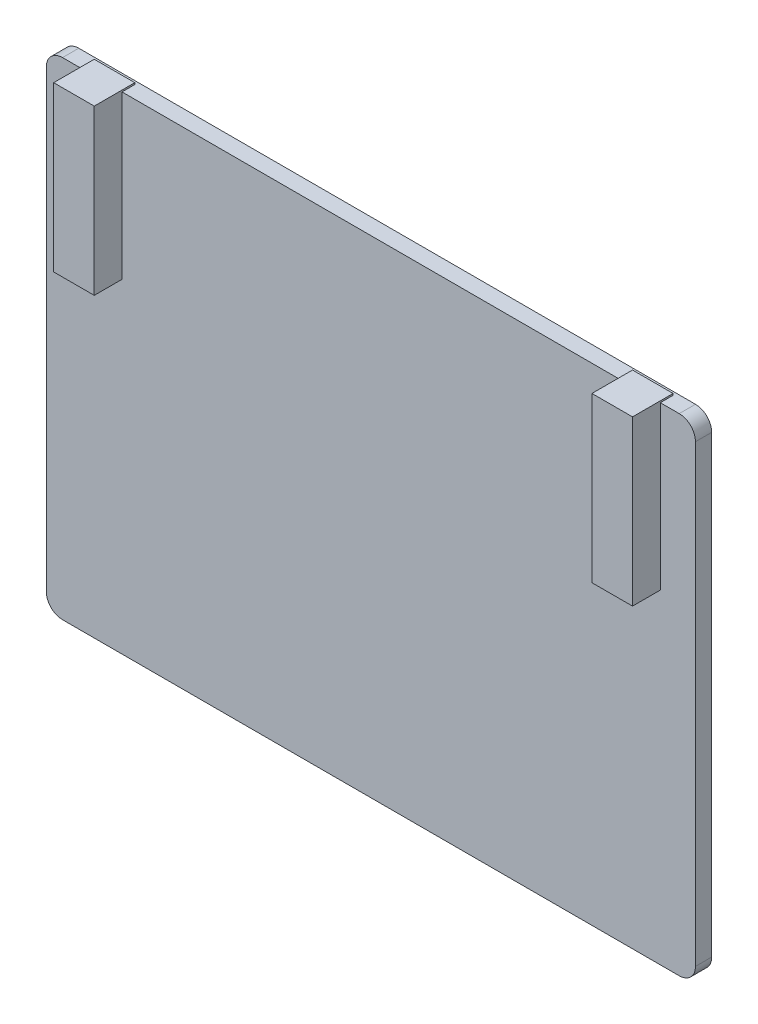
ISO-10303-21;
HEADER;
FILE_DESCRIPTION(('STEP AP214'),'2;1');
FILE_NAME('part.step','',(''),(''),'','','');
FILE_SCHEMA(('AUTOMOTIVE_DESIGN { 1 0 10303 214 1 1 1 1 }'));
ENDSEC;
DATA;
#1=APPLICATION_CONTEXT('core data for automotive mechanical design processes');
#2=APPLICATION_PROTOCOL_DEFINITION('international standard','automotive_design',2000,#1);
#3=PRODUCT_CONTEXT('',#1,'mechanical');
#4=PRODUCT('Part','Part','',(#3));
#5=PRODUCT_RELATED_PRODUCT_CATEGORY('part','',(#4));
#6=PRODUCT_DEFINITION_FORMATION('','',#4);
#7=PRODUCT_DEFINITION_CONTEXT('part definition',#1,'design');
#8=PRODUCT_DEFINITION('design','',#6,#7);
#9=PRODUCT_DEFINITION_SHAPE('','',#8);
#10=(LENGTH_UNIT() NAMED_UNIT(*) SI_UNIT(.MILLI.,.METRE.));
#11=(NAMED_UNIT(*) PLANE_ANGLE_UNIT() SI_UNIT($,.RADIAN.));
#12=(NAMED_UNIT(*) SI_UNIT($,.STERADIAN.) SOLID_ANGLE_UNIT());
#13=UNCERTAINTY_MEASURE_WITH_UNIT(LENGTH_MEASURE(1.E-05),#10,'distance_accuracy_value','');
#14=(GEOMETRIC_REPRESENTATION_CONTEXT(3) GLOBAL_UNCERTAINTY_ASSIGNED_CONTEXT((#13)) GLOBAL_UNIT_ASSIGNED_CONTEXT((#10,
#11,#12)) REPRESENTATION_CONTEXT('',''));
#15=CARTESIAN_POINT('',(0.,0.,0.));
#16=DIRECTION('',(0.,0.,1.));
#17=DIRECTION('',(1.,0.,0.));
#18=AXIS2_PLACEMENT_3D('',#15,#16,#17);
#19=CARTESIAN_POINT('',(0.,0.,2.54));
#20=DIRECTION('',(0.,0.,-1.));
#21=DIRECTION('',(-1.,0.,0.));
#22=AXIS2_PLACEMENT_3D('',#19,#20,#21);
#23=PLANE('',#22);
#24=DIRECTION('',(1.,0.,0.));
#25=VECTOR('',#24,1.);
#26=CARTESIAN_POINT('',(0.,12.7,2.54));
#27=LINE('',#26,#25);
#28=CARTESIAN_POINT('',(38.948995,12.7,2.54));
#29=VERTEX_POINT('',#28);
#30=CARTESIAN_POINT('',(39.8719820254592,12.7,2.54));
#31=VERTEX_POINT('',#30);
#32=EDGE_CURVE('E204',#29,#31,#27,.T.);
#33=ORIENTED_EDGE('',*,*,#32,.F.);
#34=DIRECTION('',(0.,1.,0.));
#35=VECTOR('',#34,1.);
#36=CARTESIAN_POINT('',(38.948995,0.,2.54));
#37=LINE('',#36,#35);
#38=CARTESIAN_POINT('',(38.948995,38.1,2.54));
#39=VERTEX_POINT('',#38);
#40=EDGE_CURVE('E287',#29,#39,#37,.T.);
#41=ORIENTED_EDGE('',*,*,#40,.T.);
#42=DIRECTION('',(-1.,0.,0.));
#43=VECTOR('',#42,1.);
#44=CARTESIAN_POINT('',(-50.8,38.1,2.54));
#45=LINE('',#44,#43);
#46=CARTESIAN_POINT('',(-38.948995,38.1,2.54));
#47=VERTEX_POINT('',#46);
#48=EDGE_CURVE('E274',#39,#47,#45,.T.);
#49=ORIENTED_EDGE('',*,*,#48,.T.);
#50=DIRECTION('',(0.,-1.,0.));
#51=VECTOR('',#50,1.);
#52=CARTESIAN_POINT('',(-38.948995,0.,2.54));
#53=LINE('',#52,#51);
#54=CARTESIAN_POINT('',(-38.948995,12.7,2.54));
#55=VERTEX_POINT('',#54);
#56=EDGE_CURVE('E285',#47,#55,#53,.T.);
#57=ORIENTED_EDGE('',*,*,#56,.T.);
#58=DIRECTION('',(1.,0.,0.));
#59=VECTOR('',#58,1.);
#60=CARTESIAN_POINT('',(0.,12.7,2.54));
#61=LINE('',#60,#59);
#62=CARTESIAN_POINT('',(-39.8719820254592,12.7,2.54));
#63=VERTEX_POINT('',#62);
#64=EDGE_CURVE('E225',#63,#55,#61,.T.);
#65=ORIENTED_EDGE('',*,*,#64,.F.);
#66=CARTESIAN_POINT('',(-44.3760079745408,12.7,2.54));
#67=VERTEX_POINT('',#66);
#68=EDGE_CURVE('E224',#67,#63,#61,.T.);
#69=ORIENTED_EDGE('',*,*,#68,.F.);
#70=CARTESIAN_POINT('',(-45.298995,12.7,2.54));
#71=VERTEX_POINT('',#70);
#72=EDGE_CURVE('E221',#71,#67,#61,.T.);
#73=ORIENTED_EDGE('',*,*,#72,.F.);
#74=DIRECTION('',(0.,1.,0.));
#75=VECTOR('',#74,1.);
#76=CARTESIAN_POINT('',(-45.298995,0.,2.54));
#77=LINE('',#76,#75);
#78=CARTESIAN_POINT('',(-45.298995,38.1,2.54));
#79=VERTEX_POINT('',#78);
#80=EDGE_CURVE('E302',#71,#79,#77,.T.);
#81=ORIENTED_EDGE('',*,*,#80,.T.);
#82=CARTESIAN_POINT('',(-48.26,38.1,2.54));
#83=VERTEX_POINT('',#82);
#84=EDGE_CURVE('E269',#79,#83,#45,.T.);
#85=ORIENTED_EDGE('',*,*,#84,.T.);
#86=CARTESIAN_POINT('',(-48.26,35.56,2.54));
#87=DIRECTION('',(0.,0.,-1.));
#88=DIRECTION('',(-1.,0.,0.));
#89=AXIS2_PLACEMENT_3D('',#86,#87,#88);
#90=CIRCLE('',#89,2.54);
#91=CARTESIAN_POINT('',(-50.8,35.56,2.54));
#92=VERTEX_POINT('',#91);
#93=EDGE_CURVE('E499',#83,#92,#90,.F.);
#94=ORIENTED_EDGE('',*,*,#93,.T.);
#95=DIRECTION('',(0.,-1.,0.));
#96=VECTOR('',#95,1.);
#97=CARTESIAN_POINT('',(-50.8,-38.1,2.54));
#98=LINE('',#97,#96);
#99=CARTESIAN_POINT('',(-50.8,-35.56,2.54));
#100=VERTEX_POINT('',#99);
#101=EDGE_CURVE('E237',#92,#100,#98,.T.);
#102=ORIENTED_EDGE('',*,*,#101,.T.);
#103=CARTESIAN_POINT('',(-48.26,-35.56,2.54));
#104=DIRECTION('',(0.,0.,-1.));
#105=DIRECTION('',(-1.,0.,0.));
#106=AXIS2_PLACEMENT_3D('',#103,#104,#105);
#107=CIRCLE('',#106,2.54);
#108=CARTESIAN_POINT('',(-48.26,-38.1,2.54));
#109=VERTEX_POINT('',#108);
#110=EDGE_CURVE('E503',#100,#109,#107,.F.);
#111=ORIENTED_EDGE('',*,*,#110,.T.);
#112=DIRECTION('',(1.,0.,0.));
#113=VECTOR('',#112,1.);
#114=CARTESIAN_POINT('',(-50.8,-38.1,2.54));
#115=LINE('',#114,#113);
#116=CARTESIAN_POINT('',(48.26,-38.1,2.54));
#117=VERTEX_POINT('',#116);
#118=EDGE_CURVE('E232',#109,#117,#115,.T.);
#119=ORIENTED_EDGE('',*,*,#118,.T.);
#120=CARTESIAN_POINT('',(48.26,-35.56,2.54));
#121=DIRECTION('',(0.,0.,-1.));
#122=DIRECTION('',(-1.,0.,0.));
#123=AXIS2_PLACEMENT_3D('',#120,#121,#122);
#124=CIRCLE('',#123,2.54);
#125=CARTESIAN_POINT('',(50.8,-35.56,2.54));
#126=VERTEX_POINT('',#125);
#127=EDGE_CURVE('E498',#117,#126,#124,.F.);
#128=ORIENTED_EDGE('',*,*,#127,.T.);
#129=DIRECTION('',(0.,1.,0.));
#130=VECTOR('',#129,1.);
#131=CARTESIAN_POINT('',(50.8,-38.1,2.54));
#132=LINE('',#131,#130);
#133=CARTESIAN_POINT('',(50.8,35.56,2.54));
#134=VERTEX_POINT('',#133);
#135=EDGE_CURVE('E262',#126,#134,#132,.T.);
#136=ORIENTED_EDGE('',*,*,#135,.T.);
#137=CARTESIAN_POINT('',(48.26,35.56,2.54));
#138=DIRECTION('',(0.,0.,-1.));
#139=DIRECTION('',(-1.,0.,0.));
#140=AXIS2_PLACEMENT_3D('',#137,#138,#139);
#141=CIRCLE('',#140,2.54);
#142=CARTESIAN_POINT('',(48.26,38.1,2.54));
#143=VERTEX_POINT('',#142);
#144=EDGE_CURVE('E495',#134,#143,#141,.F.);
#145=ORIENTED_EDGE('',*,*,#144,.T.);
#146=CARTESIAN_POINT('',(45.298995,38.1,2.54));
#147=VERTEX_POINT('',#146);
#148=EDGE_CURVE('E243',#143,#147,#45,.T.);
#149=ORIENTED_EDGE('',*,*,#148,.T.);
#150=DIRECTION('',(0.,-1.,0.));
#151=VECTOR('',#150,1.);
#152=CARTESIAN_POINT('',(45.298995,0.,2.54));
#153=LINE('',#152,#151);
#154=CARTESIAN_POINT('',(45.298995,12.7,2.54));
#155=VERTEX_POINT('',#154);
#156=EDGE_CURVE('E369',#147,#155,#153,.T.);
#157=ORIENTED_EDGE('',*,*,#156,.T.);
#158=CARTESIAN_POINT('',(44.3760079745408,12.7,2.54));
#159=VERTEX_POINT('',#158);
#160=EDGE_CURVE('E207',#159,#155,#27,.T.);
#161=ORIENTED_EDGE('',*,*,#160,.F.);
#162=EDGE_CURVE('E192',#31,#159,#27,.T.);
#163=ORIENTED_EDGE('',*,*,#162,.F.);
#164=EDGE_LOOP('',(#33,#41,#49,#57,#65,#69,#73,#81,#85,#94,#102,#111,#119,#128,#136,#145,#149,
#157,#161,#163));
#165=FACE_BOUND('',#164,.T.);
#166=ADVANCED_FACE('F43',(#165),#23,.F.);
#167=CARTESIAN_POINT('',(-50.8,38.1,2.54));
#168=DIRECTION('',(0.,-1.,0.));
#169=DIRECTION('',(0.,0.,-1.));
#170=AXIS2_PLACEMENT_3D('',#167,#168,#169);
#171=PLANE('',#170);
#172=DIRECTION('',(1.,0.,0.));
#173=VECTOR('',#172,1.);
#174=CARTESIAN_POINT('',(-50.8,38.1,0.539749999999992));
#175=LINE('',#174,#173);
#176=CARTESIAN_POINT('',(38.948995,38.1,0.539749999999992));
#177=VERTEX_POINT('',#176);
#178=CARTESIAN_POINT('',(45.298995,38.1,0.539749999999992));
#179=VERTEX_POINT('',#178);
#180=EDGE_CURVE('E315',#177,#179,#175,.T.);
#181=ORIENTED_EDGE('',*,*,#180,.T.);
#182=DIRECTION('',(0.,0.,1.));
#183=VECTOR('',#182,1.);
#184=CARTESIAN_POINT('',(45.298995,38.1,2.54));
#185=LINE('',#184,#183);
#186=EDGE_CURVE('E11',#179,#147,#185,.T.);
#187=ORIENTED_EDGE('',*,*,#186,.T.);
#188=ORIENTED_EDGE('',*,*,#148,.F.);
#189=DIRECTION('',(0.,0.,-1.));
#190=VECTOR('',#189,1.);
#191=CARTESIAN_POINT('',(48.26,38.1,2.54));
#192=LINE('',#191,#190);
#193=CARTESIAN_POINT('',(48.26,38.1,0.));
#194=VERTEX_POINT('',#193);
#195=EDGE_CURVE('E303',#143,#194,#192,.T.);
#196=ORIENTED_EDGE('',*,*,#195,.T.);
#197=DIRECTION('',(-1.,0.,0.));
#198=VECTOR('',#197,1.);
#199=CARTESIAN_POINT('',(-50.8,38.1,0.));
#200=LINE('',#199,#198);
#201=CARTESIAN_POINT('',(-48.26,38.1,0.));
#202=VERTEX_POINT('',#201);
#203=EDGE_CURVE('E251',#194,#202,#200,.T.);
#204=ORIENTED_EDGE('',*,*,#203,.T.);
#205=DIRECTION('',(0.,0.,-1.));
#206=VECTOR('',#205,1.);
#207=CARTESIAN_POINT('',(-48.26,38.1,2.54));
#208=LINE('',#207,#206);
#209=EDGE_CURVE('E309',#202,#83,#208,.F.);
#210=ORIENTED_EDGE('',*,*,#209,.T.);
#211=ORIENTED_EDGE('',*,*,#84,.F.);
#212=DIRECTION('',(0.,0.,-1.));
#213=VECTOR('',#212,1.);
#214=CARTESIAN_POINT('',(-45.298995,38.1,2.54));
#215=LINE('',#214,#213);
#216=CARTESIAN_POINT('',(-45.298995,38.1,0.53974999999999));
#217=VERTEX_POINT('',#216);
#218=EDGE_CURVE('E297',#79,#217,#215,.T.);
#219=ORIENTED_EDGE('',*,*,#218,.T.);
#220=DIRECTION('',(1.,0.,0.));
#221=VECTOR('',#220,1.);
#222=CARTESIAN_POINT('',(-50.8,38.1,0.53974999999999));
#223=LINE('',#222,#221);
#224=CARTESIAN_POINT('',(-38.948995,38.1,0.53974999999999));
#225=VERTEX_POINT('',#224);
#226=EDGE_CURVE('E293',#217,#225,#223,.T.);
#227=ORIENTED_EDGE('',*,*,#226,.T.);
#228=DIRECTION('',(0.,0.,1.));
#229=VECTOR('',#228,1.);
#230=CARTESIAN_POINT('',(-38.948995,38.1,2.54));
#231=LINE('',#230,#229);
#232=EDGE_CURVE('E252',#225,#47,#231,.T.);
#233=ORIENTED_EDGE('',*,*,#232,.T.);
#234=ORIENTED_EDGE('',*,*,#48,.F.);
#235=DIRECTION('',(0.,0.,-1.));
#236=VECTOR('',#235,1.);
#237=CARTESIAN_POINT('',(38.948995,38.1,2.54));
#238=LINE('',#237,#236);
#239=EDGE_CURVE('E52',#39,#177,#238,.T.);
#240=ORIENTED_EDGE('',*,*,#239,.T.);
#241=EDGE_LOOP('',(#181,#187,#188,#196,#204,#210,#211,#219,#227,#233,#234,#240));
#242=FACE_BOUND('',#241,.T.);
#243=ADVANCED_FACE('F291',(#242),#171,.F.);
#244=CARTESIAN_POINT('',(50.8,-38.1,2.54));
#245=DIRECTION('',(-1.,0.,0.));
#246=DIRECTION('',(0.,0.,1.));
#247=AXIS2_PLACEMENT_3D('',#244,#245,#246);
#248=PLANE('',#247);
#249=ORIENTED_EDGE('',*,*,#135,.F.);
#250=DIRECTION('',(0.,0.,-1.));
#251=VECTOR('',#250,1.);
#252=CARTESIAN_POINT('',(50.8,-35.56,2.54));
#253=LINE('',#252,#251);
#254=CARTESIAN_POINT('',(50.8,-35.56,0.));
#255=VERTEX_POINT('',#254);
#256=EDGE_CURVE('E513',#126,#255,#253,.T.);
#257=ORIENTED_EDGE('',*,*,#256,.T.);
#258=DIRECTION('',(0.,1.,0.));
#259=VECTOR('',#258,1.);
#260=CARTESIAN_POINT('',(50.8,-38.1,0.));
#261=LINE('',#260,#259);
#262=CARTESIAN_POINT('',(50.8,35.56,0.));
#263=VERTEX_POINT('',#262);
#264=EDGE_CURVE('E247',#255,#263,#261,.T.);
#265=ORIENTED_EDGE('',*,*,#264,.T.);
#266=DIRECTION('',(0.,0.,-1.));
#267=VECTOR('',#266,1.);
#268=CARTESIAN_POINT('',(50.8,35.56,2.54));
#269=LINE('',#268,#267);
#270=EDGE_CURVE('E496',#263,#134,#269,.F.);
#271=ORIENTED_EDGE('',*,*,#270,.T.);
#272=EDGE_LOOP('',(#249,#257,#265,#271));
#273=FACE_BOUND('',#272,.T.);
#274=ADVANCED_FACE('F460',(#273),#248,.F.);
#275=CARTESIAN_POINT('',(-50.8,-38.1,2.54));
#276=DIRECTION('',(1.,0.,0.));
#277=DIRECTION('',(0.,0.,-1.));
#278=AXIS2_PLACEMENT_3D('',#275,#276,#277);
#279=PLANE('',#278);
#280=DIRECTION('',(0.,-1.,0.));
#281=VECTOR('',#280,1.);
#282=CARTESIAN_POINT('',(-50.8,-38.1,0.));
#283=LINE('',#282,#281);
#284=CARTESIAN_POINT('',(-50.8,35.56,0.));
#285=VERTEX_POINT('',#284);
#286=CARTESIAN_POINT('',(-50.8,-35.56,0.));
#287=VERTEX_POINT('',#286);
#288=EDGE_CURVE('E256',#285,#287,#283,.T.);
#289=ORIENTED_EDGE('',*,*,#288,.T.);
#290=DIRECTION('',(0.,0.,-1.));
#291=VECTOR('',#290,1.);
#292=CARTESIAN_POINT('',(-50.8,-35.56,2.54));
#293=LINE('',#292,#291);
#294=EDGE_CURVE('E505',#287,#100,#293,.F.);
#295=ORIENTED_EDGE('',*,*,#294,.T.);
#296=ORIENTED_EDGE('',*,*,#101,.F.);
#297=DIRECTION('',(0.,0.,-1.));
#298=VECTOR('',#297,1.);
#299=CARTESIAN_POINT('',(-50.8,35.56,2.54));
#300=LINE('',#299,#298);
#301=EDGE_CURVE('E522',#92,#285,#300,.T.);
#302=ORIENTED_EDGE('',*,*,#301,.T.);
#303=EDGE_LOOP('',(#289,#295,#296,#302));
#304=FACE_BOUND('',#303,.T.);
#305=ADVANCED_FACE('F472',(#304),#279,.F.);
#306=CARTESIAN_POINT('',(-50.8,-38.1,2.54));
#307=DIRECTION('',(0.,1.,0.));
#308=DIRECTION('',(0.,0.,1.));
#309=AXIS2_PLACEMENT_3D('',#306,#307,#308);
#310=PLANE('',#309);
#311=ORIENTED_EDGE('',*,*,#118,.F.);
#312=DIRECTION('',(0.,0.,-1.));
#313=VECTOR('',#312,1.);
#314=CARTESIAN_POINT('',(-48.26,-38.1,2.54));
#315=LINE('',#314,#313);
#316=CARTESIAN_POINT('',(-48.26,-38.1,0.));
#317=VERTEX_POINT('',#316);
#318=EDGE_CURVE('E217',#109,#317,#315,.T.);
#319=ORIENTED_EDGE('',*,*,#318,.T.);
#320=DIRECTION('',(1.,0.,0.));
#321=VECTOR('',#320,1.);
#322=CARTESIAN_POINT('',(-50.8,-38.1,0.));
#323=LINE('',#322,#321);
#324=CARTESIAN_POINT('',(48.26,-38.1,0.));
#325=VERTEX_POINT('',#324);
#326=EDGE_CURVE('E259',#317,#325,#323,.T.);
#327=ORIENTED_EDGE('',*,*,#326,.T.);
#328=DIRECTION('',(0.,0.,-1.));
#329=VECTOR('',#328,1.);
#330=CARTESIAN_POINT('',(48.26,-38.1,2.54));
#331=LINE('',#330,#329);
#332=EDGE_CURVE('E215',#325,#117,#331,.F.);
#333=ORIENTED_EDGE('',*,*,#332,.T.);
#334=EDGE_LOOP('',(#311,#319,#327,#333));
#335=FACE_BOUND('',#334,.T.);
#336=ADVANCED_FACE('F468',(#335),#310,.F.);
#337=CARTESIAN_POINT('',(0.,0.,0.));
#338=DIRECTION('',(0.,0.,-1.));
#339=DIRECTION('',(-1.,0.,0.));
#340=AXIS2_PLACEMENT_3D('',#337,#338,#339);
#341=PLANE('',#340);
#342=ORIENTED_EDGE('',*,*,#326,.F.);
#343=CARTESIAN_POINT('',(-48.26,-35.56,0.));
#344=DIRECTION('',(0.,0.,-1.));
#345=DIRECTION('',(-1.,0.,0.));
#346=AXIS2_PLACEMENT_3D('',#343,#344,#345);
#347=CIRCLE('',#346,2.54);
#348=EDGE_CURVE('E529',#317,#287,#347,.T.);
#349=ORIENTED_EDGE('',*,*,#348,.T.);
#350=ORIENTED_EDGE('',*,*,#288,.F.);
#351=CARTESIAN_POINT('',(-48.26,35.56,0.));
#352=DIRECTION('',(0.,0.,-1.));
#353=DIRECTION('',(-1.,0.,0.));
#354=AXIS2_PLACEMENT_3D('',#351,#352,#353);
#355=CIRCLE('',#354,2.54);
#356=EDGE_CURVE('E540',#285,#202,#355,.T.);
#357=ORIENTED_EDGE('',*,*,#356,.T.);
#358=ORIENTED_EDGE('',*,*,#203,.F.);
#359=CARTESIAN_POINT('',(48.26,35.56,0.));
#360=DIRECTION('',(0.,0.,-1.));
#361=DIRECTION('',(-1.,0.,0.));
#362=AXIS2_PLACEMENT_3D('',#359,#360,#361);
#363=CIRCLE('',#362,2.54);
#364=EDGE_CURVE('E537',#194,#263,#363,.T.);
#365=ORIENTED_EDGE('',*,*,#364,.T.);
#366=ORIENTED_EDGE('',*,*,#264,.F.);
#367=CARTESIAN_POINT('',(48.26,-35.56,0.));
#368=DIRECTION('',(0.,0.,-1.));
#369=DIRECTION('',(-1.,0.,0.));
#370=AXIS2_PLACEMENT_3D('',#367,#368,#369);
#371=CIRCLE('',#370,2.54);
#372=EDGE_CURVE('E534',#255,#325,#371,.T.);
#373=ORIENTED_EDGE('',*,*,#372,.T.);
#374=EDGE_LOOP('',(#342,#349,#350,#357,#358,#365,#366,#373));
#375=FACE_BOUND('',#374,.T.);
#376=ADVANCED_FACE('F465',(#375),#341,.T.);
#377=CARTESIAN_POINT('',(-42.123995,12.7,3.71474999999999));
#378=DIRECTION('',(0.,1.,0.));
#379=DIRECTION('',(0.,0.,1.));
#380=AXIS2_PLACEMENT_3D('',#377,#378,#379);
#381=PLANE('',#380);
#382=ORIENTED_EDGE('',*,*,#72,.T.);
#383=CARTESIAN_POINT('',(-42.123995,12.7,3.71474999999999));
#384=DIRECTION('',(0.,-1.,0.));
#385=DIRECTION('',(0.,0.,-1.));
#386=AXIS2_PLACEMENT_3D('',#383,#384,#385);
#387=CIRCLE('',#386,2.54);
#388=EDGE_CURVE('E432',#63,#67,#387,.T.);
#389=ORIENTED_EDGE('',*,*,#388,.F.);
#390=ORIENTED_EDGE('',*,*,#64,.T.);
#391=DIRECTION('',(0.,0.,1.));
#392=VECTOR('',#391,1.);
#393=CARTESIAN_POINT('',(-38.948995,12.7,6.88974999999999));
#394=LINE('',#393,#392);
#395=CARTESIAN_POINT('',(-38.948995,12.7,6.88974999999999));
#396=VERTEX_POINT('',#395);
#397=EDGE_CURVE('E300',#55,#396,#394,.T.);
#398=ORIENTED_EDGE('',*,*,#397,.T.);
#399=DIRECTION('',(-1.,0.,0.));
#400=VECTOR('',#399,1.);
#401=CARTESIAN_POINT('',(-45.298995,12.7,6.88974999999999));
#402=LINE('',#401,#400);
#403=CARTESIAN_POINT('',(-45.298995,12.7,6.88974999999999));
#404=VERTEX_POINT('',#403);
#405=EDGE_CURVE('E376',#396,#404,#402,.T.);
#406=ORIENTED_EDGE('',*,*,#405,.T.);
#407=DIRECTION('',(0.,0.,-1.));
#408=VECTOR('',#407,1.);
#409=CARTESIAN_POINT('',(-45.298995,12.7,6.88974999999999));
#410=LINE('',#409,#408);
#411=EDGE_CURVE('E373',#404,#71,#410,.T.);
#412=ORIENTED_EDGE('',*,*,#411,.T.);
#413=EDGE_LOOP('',(#382,#389,#390,#398,#406,#412));
#414=FACE_BOUND('',#413,.T.);
#415=ADVANCED_FACE('F428',(#414),#381,.F.);
#416=CARTESIAN_POINT('',(42.123995,12.7,3.71474999999999));
#417=DIRECTION('',(0.,1.,0.));
#418=DIRECTION('',(0.,0.,1.));
#419=AXIS2_PLACEMENT_3D('',#416,#417,#418);
#420=PLANE('',#419);
#421=ORIENTED_EDGE('',*,*,#32,.T.);
#422=CARTESIAN_POINT('',(42.123995,12.7,3.71474999999999));
#423=DIRECTION('',(0.,-1.,0.));
#424=DIRECTION('',(0.,0.,-1.));
#425=AXIS2_PLACEMENT_3D('',#422,#423,#424);
#426=CIRCLE('',#425,2.54);
#427=EDGE_CURVE('E195',#159,#31,#426,.T.);
#428=ORIENTED_EDGE('',*,*,#427,.F.);
#429=ORIENTED_EDGE('',*,*,#160,.T.);
#430=DIRECTION('',(0.,0.,1.));
#431=VECTOR('',#430,1.);
#432=CARTESIAN_POINT('',(45.298995,12.7,6.88974999999999));
#433=LINE('',#432,#431);
#434=CARTESIAN_POINT('',(45.298995,12.7,6.88974999999999));
#435=VERTEX_POINT('',#434);
#436=EDGE_CURVE('E358',#155,#435,#433,.T.);
#437=ORIENTED_EDGE('',*,*,#436,.T.);
#438=DIRECTION('',(-1.,0.,0.));
#439=VECTOR('',#438,1.);
#440=CARTESIAN_POINT('',(38.948995,12.7,6.88974999999999));
#441=LINE('',#440,#439);
#442=CARTESIAN_POINT('',(38.948995,12.7,6.88974999999999));
#443=VERTEX_POINT('',#442);
#444=EDGE_CURVE('E361',#435,#443,#441,.T.);
#445=ORIENTED_EDGE('',*,*,#444,.T.);
#446=DIRECTION('',(0.,0.,-1.));
#447=VECTOR('',#446,1.);
#448=CARTESIAN_POINT('',(38.948995,12.7,6.88974999999999));
#449=LINE('',#448,#447);
#450=EDGE_CURVE('E213',#443,#29,#449,.T.);
#451=ORIENTED_EDGE('',*,*,#450,.T.);
#452=EDGE_LOOP('',(#421,#428,#429,#437,#445,#451));
#453=FACE_BOUND('',#452,.T.);
#454=ADVANCED_FACE('F211',(#453),#420,.F.);
#455=CARTESIAN_POINT('',(-48.26,-35.56,2.54));
#456=DIRECTION('',(0.,0.,-1.));
#457=DIRECTION('',(-1.,0.,0.));
#458=AXIS2_PLACEMENT_3D('',#455,#456,#457);
#459=CYLINDRICAL_SURFACE('',#458,2.54);
#460=ORIENTED_EDGE('',*,*,#110,.F.);
#461=ORIENTED_EDGE('',*,*,#294,.F.);
#462=ORIENTED_EDGE('',*,*,#348,.F.);
#463=ORIENTED_EDGE('',*,*,#318,.F.);
#464=EDGE_LOOP('',(#460,#461,#462,#463));
#465=FACE_BOUND('',#464,.T.);
#466=ADVANCED_FACE('F479',(#465),#459,.T.);
#467=CARTESIAN_POINT('',(48.26,-35.56,2.54));
#468=DIRECTION('',(0.,0.,-1.));
#469=DIRECTION('',(-1.,0.,0.));
#470=AXIS2_PLACEMENT_3D('',#467,#468,#469);
#471=CYLINDRICAL_SURFACE('',#470,2.54);
#472=ORIENTED_EDGE('',*,*,#127,.F.);
#473=ORIENTED_EDGE('',*,*,#332,.F.);
#474=ORIENTED_EDGE('',*,*,#372,.F.);
#475=ORIENTED_EDGE('',*,*,#256,.F.);
#476=EDGE_LOOP('',(#472,#473,#474,#475));
#477=FACE_BOUND('',#476,.T.);
#478=ADVANCED_FACE('F482',(#477),#471,.T.);
#479=CARTESIAN_POINT('',(48.26,35.56,2.54));
#480=DIRECTION('',(0.,0.,-1.));
#481=DIRECTION('',(-1.,0.,0.));
#482=AXIS2_PLACEMENT_3D('',#479,#480,#481);
#483=CYLINDRICAL_SURFACE('',#482,2.54);
#484=ORIENTED_EDGE('',*,*,#144,.F.);
#485=ORIENTED_EDGE('',*,*,#270,.F.);
#486=ORIENTED_EDGE('',*,*,#364,.F.);
#487=ORIENTED_EDGE('',*,*,#195,.F.);
#488=EDGE_LOOP('',(#484,#485,#486,#487));
#489=FACE_BOUND('',#488,.T.);
#490=ADVANCED_FACE('F485',(#489),#483,.T.);
#491=CARTESIAN_POINT('',(-48.26,35.56,2.54));
#492=DIRECTION('',(0.,0.,-1.));
#493=DIRECTION('',(-1.,0.,0.));
#494=AXIS2_PLACEMENT_3D('',#491,#492,#493);
#495=CYLINDRICAL_SURFACE('',#494,2.54);
#496=ORIENTED_EDGE('',*,*,#93,.F.);
#497=ORIENTED_EDGE('',*,*,#209,.F.);
#498=ORIENTED_EDGE('',*,*,#356,.F.);
#499=ORIENTED_EDGE('',*,*,#301,.F.);
#500=EDGE_LOOP('',(#496,#497,#498,#499));
#501=FACE_BOUND('',#500,.T.);
#502=ADVANCED_FACE('F45',(#501),#495,.T.);
#503=CARTESIAN_POINT('',(-45.298995,3.71974387893084,0.53974999999999));
#504=DIRECTION('',(0.,0.,-1.));
#505=DIRECTION('',(-1.,0.,0.));
#506=AXIS2_PLACEMENT_3D('',#503,#504,#505);
#507=PLANE('',#506);
#508=ORIENTED_EDGE('',*,*,#226,.F.);
#509=DIRECTION('',(0.,1.,0.));
#510=VECTOR('',#509,1.);
#511=CARTESIAN_POINT('',(-45.298995,3.71974387893084,0.53974999999999));
#512=LINE('',#511,#510);
#513=CARTESIAN_POINT('',(-45.298995,38.354,0.53974999999999));
#514=VERTEX_POINT('',#513);
#515=EDGE_CURVE('E403',#217,#514,#512,.T.);
#516=ORIENTED_EDGE('',*,*,#515,.T.);
#517=DIRECTION('',(-1.,0.,0.));
#518=VECTOR('',#517,1.);
#519=CARTESIAN_POINT('',(-45.298995,38.354,0.53974999999999));
#520=LINE('',#519,#518);
#521=CARTESIAN_POINT('',(-38.948995,38.354,0.53974999999999));
#522=VERTEX_POINT('',#521);
#523=EDGE_CURVE('E385',#522,#514,#520,.T.);
#524=ORIENTED_EDGE('',*,*,#523,.F.);
#525=DIRECTION('',(0.,1.,0.));
#526=VECTOR('',#525,1.);
#527=CARTESIAN_POINT('',(-38.948995,3.71974387893084,0.53974999999999));
#528=LINE('',#527,#526);
#529=EDGE_CURVE('E397',#225,#522,#528,.T.);
#530=ORIENTED_EDGE('',*,*,#529,.F.);
#531=EDGE_LOOP('',(#508,#516,#524,#530));
#532=FACE_BOUND('',#531,.T.);
#533=ADVANCED_FACE('F415',(#532),#507,.T.);
#534=CARTESIAN_POINT('',(-38.948995,3.71974387893084,6.88974999999999));
#535=DIRECTION('',(1.,0.,0.));
#536=DIRECTION('',(0.,0.,-1.));
#537=AXIS2_PLACEMENT_3D('',#534,#535,#536);
#538=PLANE('',#537);
#539=ORIENTED_EDGE('',*,*,#232,.F.);
#540=ORIENTED_EDGE('',*,*,#529,.T.);
#541=DIRECTION('',(0.,0.,-1.));
#542=VECTOR('',#541,1.);
#543=CARTESIAN_POINT('',(-38.948995,38.354,6.88974999999999));
#544=LINE('',#543,#542);
#545=CARTESIAN_POINT('',(-38.948995,38.354,6.88974999999999));
#546=VERTEX_POINT('',#545);
#547=EDGE_CURVE('E372',#546,#522,#544,.T.);
#548=ORIENTED_EDGE('',*,*,#547,.F.);
#549=DIRECTION('',(0.,1.,0.));
#550=VECTOR('',#549,1.);
#551=CARTESIAN_POINT('',(-38.948995,3.71974387893084,6.88974999999999));
#552=LINE('',#551,#550);
#553=EDGE_CURVE('E377',#396,#546,#552,.T.);
#554=ORIENTED_EDGE('',*,*,#553,.F.);
#555=ORIENTED_EDGE('',*,*,#397,.F.);
#556=ORIENTED_EDGE('',*,*,#56,.F.);
#557=EDGE_LOOP('',(#539,#540,#548,#554,#555,#556));
#558=FACE_BOUND('',#557,.T.);
#559=ADVANCED_FACE('F298',(#558),#538,.T.);
#560=CARTESIAN_POINT('',(-45.298995,3.71974387893084,6.88974999999999));
#561=DIRECTION('',(-1.,0.,0.));
#562=DIRECTION('',(0.,0.,1.));
#563=AXIS2_PLACEMENT_3D('',#560,#561,#562);
#564=PLANE('',#563);
#565=ORIENTED_EDGE('',*,*,#218,.F.);
#566=ORIENTED_EDGE('',*,*,#80,.F.);
#567=ORIENTED_EDGE('',*,*,#411,.F.);
#568=DIRECTION('',(0.,1.,0.));
#569=VECTOR('',#568,1.);
#570=CARTESIAN_POINT('',(-45.298995,3.71974387893084,6.88974999999999));
#571=LINE('',#570,#569);
#572=CARTESIAN_POINT('',(-45.298995,38.354,6.88974999999999));
#573=VERTEX_POINT('',#572);
#574=EDGE_CURVE('E400',#404,#573,#571,.T.);
#575=ORIENTED_EDGE('',*,*,#574,.T.);
#576=DIRECTION('',(0.,0.,1.));
#577=VECTOR('',#576,1.);
#578=CARTESIAN_POINT('',(-45.298995,38.354,6.88974999999999));
#579=LINE('',#578,#577);
#580=EDGE_CURVE('E389',#514,#573,#579,.T.);
#581=ORIENTED_EDGE('',*,*,#580,.F.);
#582=ORIENTED_EDGE('',*,*,#515,.F.);
#583=EDGE_LOOP('',(#565,#566,#567,#575,#581,#582));
#584=FACE_BOUND('',#583,.T.);
#585=ADVANCED_FACE('F418',(#584),#564,.T.);
#586=CARTESIAN_POINT('',(-45.298995,3.71974387893084,6.88974999999999));
#587=DIRECTION('',(0.,0.,1.));
#588=DIRECTION('',(1.,0.,0.));
#589=AXIS2_PLACEMENT_3D('',#586,#587,#588);
#590=PLANE('',#589);
#591=ORIENTED_EDGE('',*,*,#405,.F.);
#592=ORIENTED_EDGE('',*,*,#553,.T.);
#593=DIRECTION('',(1.,0.,0.));
#594=VECTOR('',#593,1.);
#595=CARTESIAN_POINT('',(-45.298995,38.354,6.88974999999999));
#596=LINE('',#595,#594);
#597=EDGE_CURVE('E393',#573,#546,#596,.T.);
#598=ORIENTED_EDGE('',*,*,#597,.F.);
#599=ORIENTED_EDGE('',*,*,#574,.F.);
#600=EDGE_LOOP('',(#591,#592,#598,#599));
#601=FACE_BOUND('',#600,.T.);
#602=ADVANCED_FACE('F427',(#601),#590,.T.);
#603=CARTESIAN_POINT('',(-42.123995,38.354,3.71474999999999));
#604=DIRECTION('',(0.,1.,0.));
#605=DIRECTION('',(0.,0.,1.));
#606=AXIS2_PLACEMENT_3D('',#603,#604,#605);
#607=PLANE('',#606);
#608=ORIENTED_EDGE('',*,*,#547,.T.);
#609=ORIENTED_EDGE('',*,*,#523,.T.);
#610=ORIENTED_EDGE('',*,*,#580,.T.);
#611=ORIENTED_EDGE('',*,*,#597,.T.);
#612=EDGE_LOOP('',(#608,#609,#610,#611));
#613=FACE_BOUND('',#612,.T.);
#614=ADVANCED_FACE('F423',(#613),#607,.T.);
#615=CARTESIAN_POINT('',(45.298995,3.71974387893084,6.88974999999999));
#616=DIRECTION('',(1.,0.,0.));
#617=DIRECTION('',(0.,0.,-1.));
#618=AXIS2_PLACEMENT_3D('',#615,#616,#617);
#619=PLANE('',#618);
#620=ORIENTED_EDGE('',*,*,#156,.F.);
#621=ORIENTED_EDGE('',*,*,#186,.F.);
#622=DIRECTION('',(0.,1.,0.));
#623=VECTOR('',#622,1.);
#624=CARTESIAN_POINT('',(45.298995,3.71974387893084,0.539749999999992));
#625=LINE('',#624,#623);
#626=CARTESIAN_POINT('',(45.298995,38.354,0.539749999999992));
#627=VERTEX_POINT('',#626);
#628=EDGE_CURVE('E328',#179,#627,#625,.T.);
#629=ORIENTED_EDGE('',*,*,#628,.T.);
#630=DIRECTION('',(0.,0.,-1.));
#631=VECTOR('',#630,1.);
#632=CARTESIAN_POINT('',(45.298995,38.354,6.88974999999999));
#633=LINE('',#632,#631);
#634=CARTESIAN_POINT('',(45.298995,38.354,6.88974999999999));
#635=VERTEX_POINT('',#634);
#636=EDGE_CURVE('E354',#635,#627,#633,.T.);
#637=ORIENTED_EDGE('',*,*,#636,.F.);
#638=DIRECTION('',(0.,1.,0.));
#639=VECTOR('',#638,1.);
#640=CARTESIAN_POINT('',(45.298995,3.71974387893084,6.88974999999999));
#641=LINE('',#640,#639);
#642=EDGE_CURVE('E340',#435,#635,#641,.T.);
#643=ORIENTED_EDGE('',*,*,#642,.F.);
#644=ORIENTED_EDGE('',*,*,#436,.F.);
#645=EDGE_LOOP('',(#620,#621,#629,#637,#643,#644));
#646=FACE_BOUND('',#645,.T.);
#647=ADVANCED_FACE('F548',(#646),#619,.T.);
#648=CARTESIAN_POINT('',(38.948995,3.71974387893084,6.88974999999999));
#649=DIRECTION('',(-1.,0.,0.));
#650=DIRECTION('',(0.,0.,1.));
#651=AXIS2_PLACEMENT_3D('',#648,#649,#650);
#652=PLANE('',#651);
#653=ORIENTED_EDGE('',*,*,#40,.F.);
#654=ORIENTED_EDGE('',*,*,#450,.F.);
#655=DIRECTION('',(0.,1.,0.));
#656=VECTOR('',#655,1.);
#657=CARTESIAN_POINT('',(38.948995,3.71974387893084,6.88974999999999));
#658=LINE('',#657,#656);
#659=CARTESIAN_POINT('',(38.948995,38.354,6.88974999999999));
#660=VERTEX_POINT('',#659);
#661=EDGE_CURVE('E334',#443,#660,#658,.T.);
#662=ORIENTED_EDGE('',*,*,#661,.T.);
#663=DIRECTION('',(0.,0.,1.));
#664=VECTOR('',#663,1.);
#665=CARTESIAN_POINT('',(38.948995,38.354,6.88974999999999));
#666=LINE('',#665,#664);
#667=CARTESIAN_POINT('',(38.948995,38.354,0.539749999999992));
#668=VERTEX_POINT('',#667);
#669=EDGE_CURVE('E331',#668,#660,#666,.T.);
#670=ORIENTED_EDGE('',*,*,#669,.F.);
#671=DIRECTION('',(0.,1.,0.));
#672=VECTOR('',#671,1.);
#673=CARTESIAN_POINT('',(38.948995,3.71974387893084,0.539749999999992));
#674=LINE('',#673,#672);
#675=EDGE_CURVE('E326',#177,#668,#674,.T.);
#676=ORIENTED_EDGE('',*,*,#675,.F.);
#677=ORIENTED_EDGE('',*,*,#239,.F.);
#678=EDGE_LOOP('',(#653,#654,#662,#670,#676,#677));
#679=FACE_BOUND('',#678,.T.);
#680=ADVANCED_FACE('F329',(#679),#652,.T.);
#681=CARTESIAN_POINT('',(38.948995,3.71974387893084,0.539749999999992));
#682=DIRECTION('',(0.,0.,-1.));
#683=DIRECTION('',(-1.,0.,0.));
#684=AXIS2_PLACEMENT_3D('',#681,#682,#683);
#685=PLANE('',#684);
#686=ORIENTED_EDGE('',*,*,#180,.F.);
#687=ORIENTED_EDGE('',*,*,#675,.T.);
#688=DIRECTION('',(-1.,0.,0.));
#689=VECTOR('',#688,1.);
#690=CARTESIAN_POINT('',(38.948995,38.354,0.539749999999992));
#691=LINE('',#690,#689);
#692=EDGE_CURVE('E351',#627,#668,#691,.T.);
#693=ORIENTED_EDGE('',*,*,#692,.F.);
#694=ORIENTED_EDGE('',*,*,#628,.F.);
#695=EDGE_LOOP('',(#686,#687,#693,#694));
#696=FACE_BOUND('',#695,.T.);
#697=ADVANCED_FACE('F324',(#696),#685,.T.);
#698=CARTESIAN_POINT('',(38.948995,3.71974387893084,6.88974999999999));
#699=DIRECTION('',(0.,0.,1.));
#700=DIRECTION('',(1.,0.,0.));
#701=AXIS2_PLACEMENT_3D('',#698,#699,#700);
#702=PLANE('',#701);
#703=ORIENTED_EDGE('',*,*,#444,.F.);
#704=ORIENTED_EDGE('',*,*,#642,.T.);
#705=DIRECTION('',(1.,0.,0.));
#706=VECTOR('',#705,1.);
#707=CARTESIAN_POINT('',(38.948995,38.354,6.88974999999999));
#708=LINE('',#707,#706);
#709=EDGE_CURVE('E338',#660,#635,#708,.T.);
#710=ORIENTED_EDGE('',*,*,#709,.F.);
#711=ORIENTED_EDGE('',*,*,#661,.F.);
#712=EDGE_LOOP('',(#703,#704,#710,#711));
#713=FACE_BOUND('',#712,.T.);
#714=ADVANCED_FACE('F555',(#713),#702,.T.);
#715=CARTESIAN_POINT('',(42.123995,38.354,3.71474999999999));
#716=DIRECTION('',(0.,-1.,0.));
#717=DIRECTION('',(0.,0.,-1.));
#718=AXIS2_PLACEMENT_3D('',#715,#716,#717);
#719=PLANE('',#718);
#720=ORIENTED_EDGE('',*,*,#636,.T.);
#721=ORIENTED_EDGE('',*,*,#692,.T.);
#722=ORIENTED_EDGE('',*,*,#669,.T.);
#723=ORIENTED_EDGE('',*,*,#709,.T.);
#724=EDGE_LOOP('',(#720,#721,#722,#723));
#725=FACE_BOUND('',#724,.T.);
#726=ADVANCED_FACE('F452',(#725),#719,.F.);
#727=CARTESIAN_POINT('',(42.123995,12.7,3.71474999999999));
#728=DIRECTION('',(0.,-1.,0.));
#729=DIRECTION('',(0.,0.,-1.));
#730=AXIS2_PLACEMENT_3D('',#727,#728,#729);
#731=PLANE('',#730);
#732=EDGE_CURVE('E65',#31,#159,#426,.T.);
#733=ORIENTED_EDGE('',*,*,#732,.F.);
#734=ORIENTED_EDGE('',*,*,#162,.T.);
#735=EDGE_LOOP('',(#733,#734));
#736=FACE_BOUND('',#735,.T.);
#737=ADVANCED_FACE('F190',(#736),#731,.F.);
#738=CARTESIAN_POINT('',(42.123995,36.83,3.71474999999999));
#739=DIRECTION('',(0.,-1.,0.));
#740=DIRECTION('',(0.,0.,-1.));
#741=AXIS2_PLACEMENT_3D('',#738,#739,#740);
#742=CYLINDRICAL_SURFACE('',#741,2.54);
#743=CARTESIAN_POINT('',(42.123995,36.83,3.71474999999999));
#744=DIRECTION('',(0.,-1.,0.));
#745=DIRECTION('',(0.,0.,-1.));
#746=AXIS2_PLACEMENT_3D('',#743,#744,#745);
#747=CIRCLE('',#746,2.54);
#748=CARTESIAN_POINT('',(42.123995,36.83,1.17474999999999));
#749=VERTEX_POINT('',#748);
#750=EDGE_CURVE('E196',#749,#749,#747,.T.);
#751=ORIENTED_EDGE('',*,*,#750,.F.);
#752=EDGE_LOOP('',(#751));
#753=FACE_BOUND('',#752,.T.);
#754=ORIENTED_EDGE('',*,*,#427,.T.);
#755=ORIENTED_EDGE('',*,*,#732,.T.);
#756=EDGE_LOOP('',(#754,#755));
#757=FACE_BOUND('',#756,.T.);
#758=ADVANCED_FACE('F198',(#753,#757),#742,.F.);
#759=CARTESIAN_POINT('',(42.123995,36.83,3.71474999999999));
#760=DIRECTION('',(0.,-1.,0.));
#761=DIRECTION('',(0.,0.,-1.));
#762=AXIS2_PLACEMENT_3D('',#759,#760,#761);
#763=PLANE('',#762);
#764=ORIENTED_EDGE('',*,*,#750,.T.);
#765=EDGE_LOOP('',(#764));
#766=FACE_BOUND('',#765,.T.);
#767=ADVANCED_FACE('F443',(#766),#763,.T.);
#768=CARTESIAN_POINT('',(-42.123995,12.7,3.71474999999999));
#769=DIRECTION('',(0.,-1.,0.));
#770=DIRECTION('',(0.,0.,-1.));
#771=AXIS2_PLACEMENT_3D('',#768,#769,#770);
#772=PLANE('',#771);
#773=EDGE_CURVE('E58',#67,#63,#387,.T.);
#774=ORIENTED_EDGE('',*,*,#773,.F.);
#775=ORIENTED_EDGE('',*,*,#68,.T.);
#776=EDGE_LOOP('',(#774,#775));
#777=FACE_BOUND('',#776,.T.);
#778=ADVANCED_FACE('F431',(#777),#772,.F.);
#779=CARTESIAN_POINT('',(-42.123995,36.83,3.71474999999999));
#780=DIRECTION('',(0.,-1.,0.));
#781=DIRECTION('',(0.,0.,-1.));
#782=AXIS2_PLACEMENT_3D('',#779,#780,#781);
#783=CYLINDRICAL_SURFACE('',#782,2.54);
#784=CARTESIAN_POINT('',(-42.123995,36.83,3.71474999999999));
#785=DIRECTION('',(0.,-1.,0.));
#786=DIRECTION('',(0.,0.,-1.));
#787=AXIS2_PLACEMENT_3D('',#784,#785,#786);
#788=CIRCLE('',#787,2.54);
#789=CARTESIAN_POINT('',(-42.123995,36.83,1.17474999999999));
#790=VERTEX_POINT('',#789);
#791=EDGE_CURVE('E362',#790,#790,#788,.T.);
#792=ORIENTED_EDGE('',*,*,#791,.F.);
#793=EDGE_LOOP('',(#792));
#794=FACE_BOUND('',#793,.T.);
#795=ORIENTED_EDGE('',*,*,#388,.T.);
#796=ORIENTED_EDGE('',*,*,#773,.T.);
#797=EDGE_LOOP('',(#795,#796));
#798=FACE_BOUND('',#797,.T.);
#799=ADVANCED_FACE('F732',(#794,#798),#783,.F.);
#800=CARTESIAN_POINT('',(-42.123995,36.83,3.71474999999999));
#801=DIRECTION('',(0.,-1.,0.));
#802=DIRECTION('',(0.,0.,-1.));
#803=AXIS2_PLACEMENT_3D('',#800,#801,#802);
#804=PLANE('',#803);
#805=ORIENTED_EDGE('',*,*,#791,.T.);
#806=EDGE_LOOP('',(#805));
#807=FACE_BOUND('',#806,.T.);
#808=ADVANCED_FACE('F742',(#807),#804,.T.);
#809=CLOSED_SHELL('',(#166,#243,#274,#305,#336,#376,#415,#454,#466,#478,#490,#502,#533,#559,
#585,#602,#614,#647,#680,#697,#714,#726,#737,#758,#767,#778,#799,#808));
#810=MANIFOLD_SOLID_BREP('B2',#809);
#811=ADVANCED_BREP_SHAPE_REPRESENTATION('',(#18,#810),#14);
#812=SHAPE_DEFINITION_REPRESENTATION(#9,#811);
ENDSEC;
END-ISO-10303-21;
